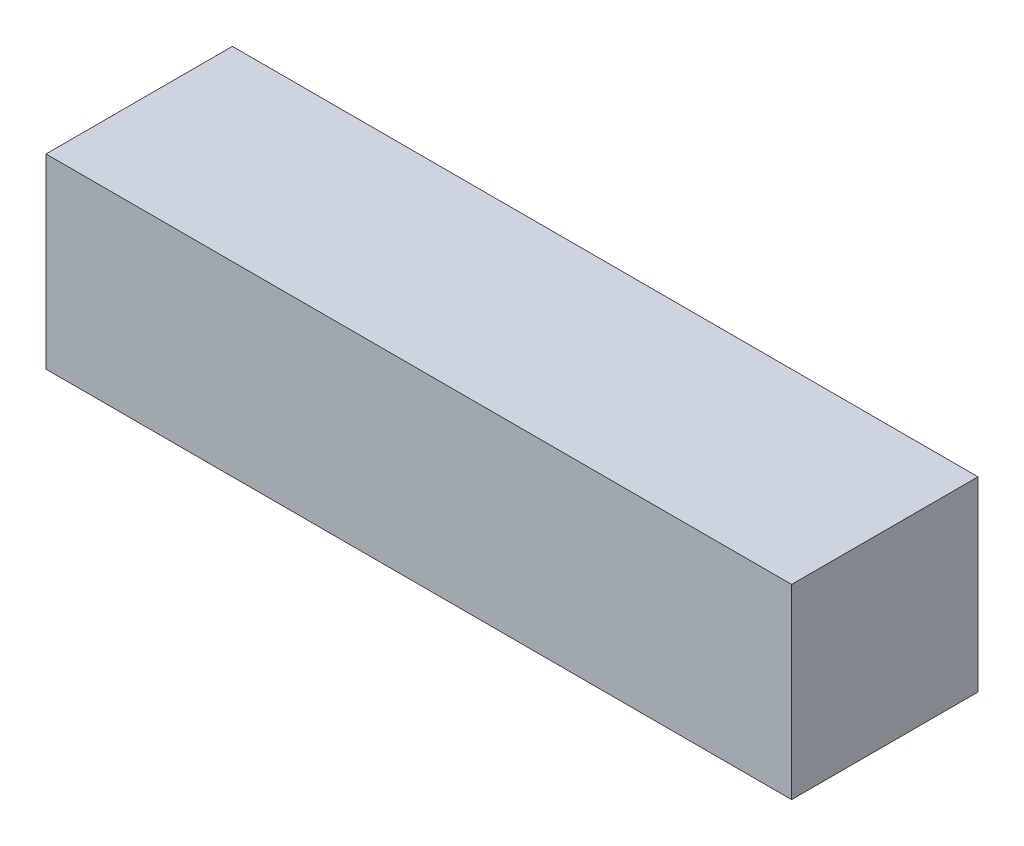
ISO-10303-21;
HEADER;
FILE_DESCRIPTION(('STEP AP214'),'2;1');
FILE_NAME('part.step','',(''),(''),'','','');
FILE_SCHEMA(('AUTOMOTIVE_DESIGN { 1 0 10303 214 1 1 1 1 }'));
ENDSEC;
DATA;
#1=APPLICATION_CONTEXT('core data for automotive mechanical design processes');
#2=APPLICATION_PROTOCOL_DEFINITION('international standard','automotive_design',2000,#1);
#3=PRODUCT_CONTEXT('',#1,'mechanical');
#4=PRODUCT('Part','Part','',(#3));
#5=PRODUCT_RELATED_PRODUCT_CATEGORY('part','',(#4));
#6=PRODUCT_DEFINITION_FORMATION('','',#4);
#7=PRODUCT_DEFINITION_CONTEXT('part definition',#1,'design');
#8=PRODUCT_DEFINITION('design','',#6,#7);
#9=PRODUCT_DEFINITION_SHAPE('','',#8);
#10=(LENGTH_UNIT() NAMED_UNIT(*) SI_UNIT(.MILLI.,.METRE.));
#11=(NAMED_UNIT(*) PLANE_ANGLE_UNIT() SI_UNIT($,.RADIAN.));
#12=(NAMED_UNIT(*) SI_UNIT($,.STERADIAN.) SOLID_ANGLE_UNIT());
#13=UNCERTAINTY_MEASURE_WITH_UNIT(LENGTH_MEASURE(1.E-05),#10,'distance_accuracy_value','');
#14=(GEOMETRIC_REPRESENTATION_CONTEXT(3) GLOBAL_UNCERTAINTY_ASSIGNED_CONTEXT((#13)) GLOBAL_UNIT_ASSIGNED_CONTEXT((#10,
#11,#12)) REPRESENTATION_CONTEXT('',''));
#15=CARTESIAN_POINT('',(0.,0.,0.));
#16=DIRECTION('',(0.,0.,1.));
#17=DIRECTION('',(1.,0.,0.));
#18=AXIS2_PLACEMENT_3D('',#15,#16,#17);
#19=CARTESIAN_POINT('',(-66.3154317732366,22.3024390243902,25.4));
#20=DIRECTION('',(1.,0.,0.));
#21=DIRECTION('',(0.,0.,-1.));
#22=AXIS2_PLACEMENT_3D('',#19,#20,#21);
#23=PLANE('',#22);
#24=DIRECTION('',(0.,-1.,0.));
#25=VECTOR('',#24,1.);
#26=CARTESIAN_POINT('',(-66.3154317732366,22.3024390243902,0.));
#27=LINE('',#26,#25);
#28=CARTESIAN_POINT('',(-66.3154317732366,22.3024390243902,0.));
#29=VERTEX_POINT('',#28);
#30=CARTESIAN_POINT('',(-66.3154317732366,-3.09756097560976,0.));
#31=VERTEX_POINT('',#30);
#32=EDGE_CURVE('E107',#29,#31,#27,.T.);
#33=ORIENTED_EDGE('',*,*,#32,.T.);
#34=DIRECTION('',(0.,0.,-1.));
#35=VECTOR('',#34,1.);
#36=CARTESIAN_POINT('',(-66.3154317732366,-3.09756097560976,25.4));
#37=LINE('',#36,#35);
#38=CARTESIAN_POINT('',(-66.3154317732366,-3.09756097560976,25.4));
#39=VERTEX_POINT('',#38);
#40=EDGE_CURVE('E11',#39,#31,#37,.T.);
#41=ORIENTED_EDGE('',*,*,#40,.F.);
#42=DIRECTION('',(0.,-1.,0.));
#43=VECTOR('',#42,1.);
#44=CARTESIAN_POINT('',(-66.3154317732366,22.3024390243902,25.4));
#45=LINE('',#44,#43);
#46=CARTESIAN_POINT('',(-66.3154317732366,22.3024390243902,25.4));
#47=VERTEX_POINT('',#46);
#48=EDGE_CURVE('E91',#47,#39,#45,.T.);
#49=ORIENTED_EDGE('',*,*,#48,.F.);
#50=DIRECTION('',(0.,0.,-1.));
#51=VECTOR('',#50,1.);
#52=CARTESIAN_POINT('',(-66.3154317732366,22.3024390243902,25.4));
#53=LINE('',#52,#51);
#54=EDGE_CURVE('E103',#47,#29,#53,.T.);
#55=ORIENTED_EDGE('',*,*,#54,.T.);
#56=EDGE_LOOP('',(#33,#41,#49,#55));
#57=FACE_BOUND('',#56,.T.);
#58=ADVANCED_FACE('F39',(#57),#23,.F.);
#59=CARTESIAN_POINT('',(-66.3154317732366,-3.09756097560976,25.4));
#60=DIRECTION('',(0.,1.,0.));
#61=DIRECTION('',(0.,0.,1.));
#62=AXIS2_PLACEMENT_3D('',#59,#60,#61);
#63=PLANE('',#62);
#64=DIRECTION('',(1.,0.,0.));
#65=VECTOR('',#64,1.);
#66=CARTESIAN_POINT('',(-66.3154317732366,-3.09756097560976,0.));
#67=LINE('',#66,#65);
#68=CARTESIAN_POINT('',(35.2845682267634,-3.09756097560976,0.));
#69=VERTEX_POINT('',#68);
#70=EDGE_CURVE('E96',#31,#69,#67,.T.);
#71=ORIENTED_EDGE('',*,*,#70,.T.);
#72=DIRECTION('',(0.,0.,-1.));
#73=VECTOR('',#72,1.);
#74=CARTESIAN_POINT('',(35.2845682267634,-3.09756097560976,25.4));
#75=LINE('',#74,#73);
#76=CARTESIAN_POINT('',(35.2845682267634,-3.09756097560976,25.4));
#77=VERTEX_POINT('',#76);
#78=EDGE_CURVE('E48',#77,#69,#75,.T.);
#79=ORIENTED_EDGE('',*,*,#78,.F.);
#80=DIRECTION('',(1.,0.,0.));
#81=VECTOR('',#80,1.);
#82=CARTESIAN_POINT('',(-66.3154317732366,-3.09756097560976,25.4));
#83=LINE('',#82,#81);
#84=EDGE_CURVE('E86',#39,#77,#83,.T.);
#85=ORIENTED_EDGE('',*,*,#84,.F.);
#86=ORIENTED_EDGE('',*,*,#40,.T.);
#87=EDGE_LOOP('',(#71,#79,#85,#86));
#88=FACE_BOUND('',#87,.T.);
#89=ADVANCED_FACE('F95',(#88),#63,.F.);
#90=CARTESIAN_POINT('',(35.2845682267634,22.3024390243902,25.4));
#91=DIRECTION('',(-1.,0.,0.));
#92=DIRECTION('',(0.,-1.,0.));
#93=AXIS2_PLACEMENT_3D('',#90,#91,#92);
#94=PLANE('',#93);
#95=DIRECTION('',(0.,1.,0.));
#96=VECTOR('',#95,1.);
#97=CARTESIAN_POINT('',(35.2845682267634,22.3024390243902,0.));
#98=LINE('',#97,#96);
#99=CARTESIAN_POINT('',(35.2845682267634,22.3024390243902,0.));
#100=VERTEX_POINT('',#99);
#101=EDGE_CURVE('E73',#69,#100,#98,.T.);
#102=ORIENTED_EDGE('',*,*,#101,.T.);
#103=DIRECTION('',(0.,0.,-1.));
#104=VECTOR('',#103,1.);
#105=CARTESIAN_POINT('',(35.2845682267634,22.3024390243902,25.4));
#106=LINE('',#105,#104);
#107=CARTESIAN_POINT('',(35.2845682267634,22.3024390243902,25.4));
#108=VERTEX_POINT('',#107);
#109=EDGE_CURVE('E98',#108,#100,#106,.T.);
#110=ORIENTED_EDGE('',*,*,#109,.F.);
#111=DIRECTION('',(0.,1.,0.));
#112=VECTOR('',#111,1.);
#113=CARTESIAN_POINT('',(35.2845682267634,22.3024390243902,25.4));
#114=LINE('',#113,#112);
#115=EDGE_CURVE('E89',#77,#108,#114,.T.);
#116=ORIENTED_EDGE('',*,*,#115,.F.);
#117=ORIENTED_EDGE('',*,*,#78,.T.);
#118=EDGE_LOOP('',(#102,#110,#116,#117));
#119=FACE_BOUND('',#118,.T.);
#120=ADVANCED_FACE('F99',(#119),#94,.F.);
#121=CARTESIAN_POINT('',(-66.3154317732366,22.3024390243902,25.4));
#122=DIRECTION('',(0.,-1.,0.));
#123=DIRECTION('',(0.,0.,-1.));
#124=AXIS2_PLACEMENT_3D('',#121,#122,#123);
#125=PLANE('',#124);
#126=DIRECTION('',(-1.,0.,0.));
#127=VECTOR('',#126,1.);
#128=CARTESIAN_POINT('',(-66.3154317732366,22.3024390243902,0.));
#129=LINE('',#128,#127);
#130=EDGE_CURVE('E79',#100,#29,#129,.T.);
#131=ORIENTED_EDGE('',*,*,#130,.T.);
#132=ORIENTED_EDGE('',*,*,#54,.F.);
#133=DIRECTION('',(-1.,0.,0.));
#134=VECTOR('',#133,1.);
#135=CARTESIAN_POINT('',(-66.3154317732366,22.3024390243902,25.4));
#136=LINE('',#135,#134);
#137=EDGE_CURVE('E56',#108,#47,#136,.T.);
#138=ORIENTED_EDGE('',*,*,#137,.F.);
#139=ORIENTED_EDGE('',*,*,#109,.T.);
#140=EDGE_LOOP('',(#131,#132,#138,#139));
#141=FACE_BOUND('',#140,.T.);
#142=ADVANCED_FACE('F120',(#141),#125,.F.);
#143=CARTESIAN_POINT('',(0.,0.,25.4));
#144=DIRECTION('',(0.,0.,1.));
#145=DIRECTION('',(1.,0.,0.));
#146=AXIS2_PLACEMENT_3D('',#143,#144,#145);
#147=PLANE('',#146);
#148=ORIENTED_EDGE('',*,*,#48,.T.);
#149=ORIENTED_EDGE('',*,*,#84,.T.);
#150=ORIENTED_EDGE('',*,*,#115,.T.);
#151=ORIENTED_EDGE('',*,*,#137,.T.);
#152=EDGE_LOOP('',(#148,#149,#150,#151));
#153=FACE_BOUND('',#152,.T.);
#154=ADVANCED_FACE('F87',(#153),#147,.T.);
#155=CARTESIAN_POINT('',(0.,0.,0.));
#156=DIRECTION('',(0.,0.,1.));
#157=DIRECTION('',(1.,0.,0.));
#158=AXIS2_PLACEMENT_3D('',#155,#156,#157);
#159=PLANE('',#158);
#160=ORIENTED_EDGE('',*,*,#32,.F.);
#161=ORIENTED_EDGE('',*,*,#130,.F.);
#162=ORIENTED_EDGE('',*,*,#101,.F.);
#163=ORIENTED_EDGE('',*,*,#70,.F.);
#164=EDGE_LOOP('',(#160,#161,#162,#163));
#165=FACE_BOUND('',#164,.T.);
#166=ADVANCED_FACE('F123',(#165),#159,.F.);
#167=CLOSED_SHELL('',(#58,#89,#120,#142,#154,#166));
#168=MANIFOLD_SOLID_BREP('B2',#167);
#169=ADVANCED_BREP_SHAPE_REPRESENTATION('',(#18,#168),#14);
#170=SHAPE_DEFINITION_REPRESENTATION(#9,#169);
ENDSEC;
END-ISO-10303-21;
